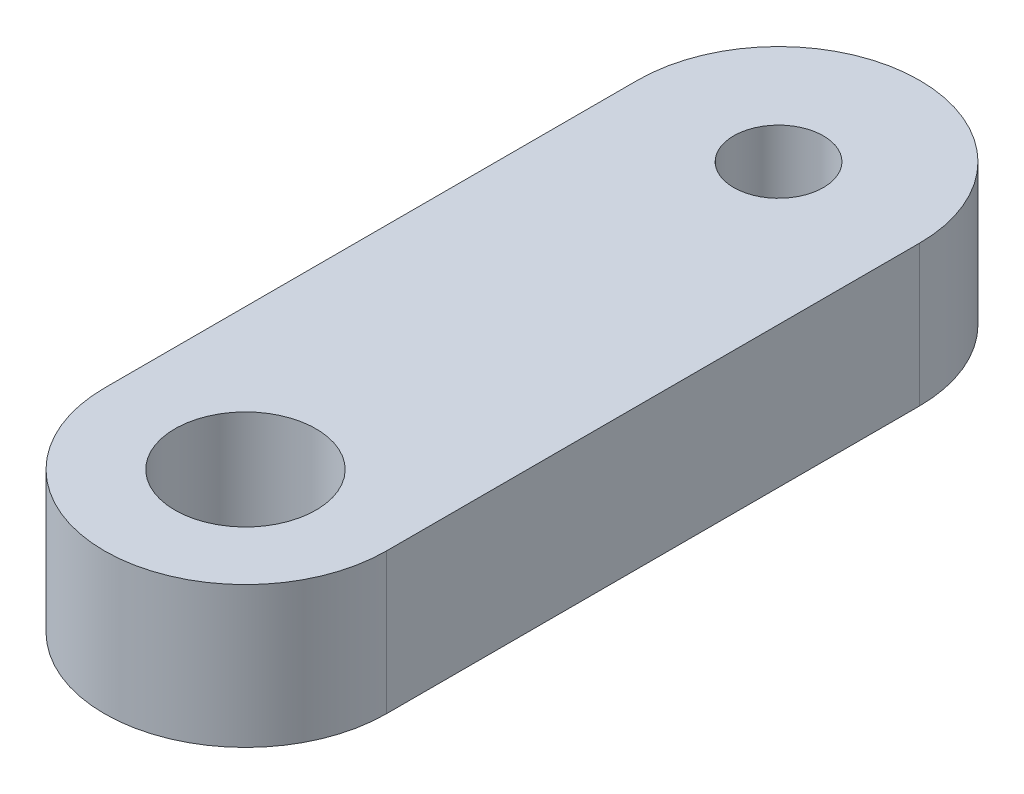
ISO-10303-21;
HEADER;
FILE_DESCRIPTION(('STEP AP214'),'2;1');
FILE_NAME('part.step','',(''),(''),'','','');
FILE_SCHEMA(('AUTOMOTIVE_DESIGN { 1 0 10303 214 1 1 1 1 }'));
ENDSEC;
DATA;
#1=APPLICATION_CONTEXT('core data for automotive mechanical design processes');
#2=APPLICATION_PROTOCOL_DEFINITION('international standard','automotive_design',2000,#1);
#3=PRODUCT_CONTEXT('',#1,'mechanical');
#4=PRODUCT('Part','Part','',(#3));
#5=PRODUCT_RELATED_PRODUCT_CATEGORY('part','',(#4));
#6=PRODUCT_DEFINITION_FORMATION('','',#4);
#7=PRODUCT_DEFINITION_CONTEXT('part definition',#1,'design');
#8=PRODUCT_DEFINITION('design','',#6,#7);
#9=PRODUCT_DEFINITION_SHAPE('','',#8);
#10=(LENGTH_UNIT() NAMED_UNIT(*) SI_UNIT(.MILLI.,.METRE.));
#11=(NAMED_UNIT(*) PLANE_ANGLE_UNIT() SI_UNIT($,.RADIAN.));
#12=(NAMED_UNIT(*) SI_UNIT($,.STERADIAN.) SOLID_ANGLE_UNIT());
#13=UNCERTAINTY_MEASURE_WITH_UNIT(LENGTH_MEASURE(1.E-05),#10,'distance_accuracy_value','');
#14=(GEOMETRIC_REPRESENTATION_CONTEXT(3) GLOBAL_UNCERTAINTY_ASSIGNED_CONTEXT((#13)) GLOBAL_UNIT_ASSIGNED_CONTEXT((#10,
#11,#12)) REPRESENTATION_CONTEXT('',''));
#15=CARTESIAN_POINT('',(0.,0.,0.));
#16=DIRECTION('',(0.,0.,1.));
#17=DIRECTION('',(1.,0.,0.));
#18=AXIS2_PLACEMENT_3D('',#15,#16,#17);
#19=CARTESIAN_POINT('',(0.,6.35,-24.));
#20=DIRECTION('',(0.,1.,0.));
#21=DIRECTION('',(0.,0.,1.));
#22=AXIS2_PLACEMENT_3D('',#19,#20,#21);
#23=PLANE('',#22);
#24=CARTESIAN_POINT('',(0.,6.35,-24.));
#25=DIRECTION('',(0.,1.,0.));
#26=DIRECTION('',(0.,0.,1.));
#27=AXIS2_PLACEMENT_3D('',#24,#25,#26);
#28=CIRCLE('',#27,2.0193);
#29=CARTESIAN_POINT('',(0.,6.35,-21.9807));
#30=VERTEX_POINT('',#29);
#31=EDGE_CURVE('E124',#30,#30,#28,.T.);
#32=ORIENTED_EDGE('',*,*,#31,.F.);
#33=EDGE_LOOP('',(#32));
#34=FACE_BOUND('',#33,.T.);
#35=CARTESIAN_POINT('',(0.,6.35,-24.));
#36=DIRECTION('',(0.,1.,0.));
#37=DIRECTION('',(0.,0.,1.));
#38=AXIS2_PLACEMENT_3D('',#35,#36,#37);
#39=CIRCLE('',#38,6.34999999999999);
#40=CARTESIAN_POINT('',(6.35,6.35,-24.));
#41=VERTEX_POINT('',#40);
#42=CARTESIAN_POINT('',(-6.34999999999999,6.35,-24.));
#43=VERTEX_POINT('',#42);
#44=EDGE_CURVE('E89',#41,#43,#39,.T.);
#45=ORIENTED_EDGE('',*,*,#44,.T.);
#46=DIRECTION('',(0.,0.,1.));
#47=VECTOR('',#46,1.);
#48=CARTESIAN_POINT('',(-6.34999999999999,6.35,-24.));
#49=LINE('',#48,#47);
#50=CARTESIAN_POINT('',(-6.34999999999999,6.35,0.));
#51=VERTEX_POINT('',#50);
#52=EDGE_CURVE('E84',#43,#51,#49,.T.);
#53=ORIENTED_EDGE('',*,*,#52,.T.);
#54=CARTESIAN_POINT('',(0.,6.35,0.));
#55=DIRECTION('',(0.,1.,0.));
#56=DIRECTION('',(0.,0.,1.));
#57=AXIS2_PLACEMENT_3D('',#54,#55,#56);
#58=CIRCLE('',#57,6.34999999999999);
#59=CARTESIAN_POINT('',(6.35,6.35,0.));
#60=VERTEX_POINT('',#59);
#61=EDGE_CURVE('E87',#51,#60,#58,.T.);
#62=ORIENTED_EDGE('',*,*,#61,.T.);
#63=DIRECTION('',(0.,0.,-1.));
#64=VECTOR('',#63,1.);
#65=CARTESIAN_POINT('',(6.35,6.35,-24.));
#66=LINE('',#65,#64);
#67=EDGE_CURVE('E54',#60,#41,#66,.T.);
#68=ORIENTED_EDGE('',*,*,#67,.T.);
#69=EDGE_LOOP('',(#45,#53,#62,#68));
#70=FACE_BOUND('',#69,.T.);
#71=CARTESIAN_POINT('',(0.,6.35,0.));
#72=DIRECTION('',(0.,1.,0.));
#73=DIRECTION('',(0.,0.,1.));
#74=AXIS2_PLACEMENT_3D('',#71,#72,#73);
#75=CIRCLE('',#74,3.175);
#76=CARTESIAN_POINT('',(0.,6.35,3.175));
#77=VERTEX_POINT('',#76);
#78=EDGE_CURVE('E104',#77,#77,#75,.T.);
#79=ORIENTED_EDGE('',*,*,#78,.F.);
#80=EDGE_LOOP('',(#79));
#81=FACE_BOUND('',#80,.T.);
#82=ADVANCED_FACE('F37',(#34,#70,#81),#23,.T.);
#83=CARTESIAN_POINT('',(0.,0.,-24.));
#84=DIRECTION('',(0.,1.,0.));
#85=DIRECTION('',(0.,0.,1.));
#86=AXIS2_PLACEMENT_3D('',#83,#84,#85);
#87=PLANE('',#86);
#88=CARTESIAN_POINT('',(0.,0.,-24.));
#89=DIRECTION('',(0.,1.,0.));
#90=DIRECTION('',(0.,0.,1.));
#91=AXIS2_PLACEMENT_3D('',#88,#89,#90);
#92=CIRCLE('',#91,2.0193);
#93=CARTESIAN_POINT('',(0.,0.,-21.9807));
#94=VERTEX_POINT('',#93);
#95=EDGE_CURVE('E119',#94,#94,#92,.T.);
#96=ORIENTED_EDGE('',*,*,#95,.T.);
#97=EDGE_LOOP('',(#96));
#98=FACE_BOUND('',#97,.T.);
#99=CARTESIAN_POINT('',(0.,0.,-24.));
#100=DIRECTION('',(0.,1.,0.));
#101=DIRECTION('',(0.,0.,1.));
#102=AXIS2_PLACEMENT_3D('',#99,#100,#101);
#103=CIRCLE('',#102,6.34999999999999);
#104=CARTESIAN_POINT('',(6.35,0.,-24.));
#105=VERTEX_POINT('',#104);
#106=CARTESIAN_POINT('',(-6.34999999999999,0.,-24.));
#107=VERTEX_POINT('',#106);
#108=EDGE_CURVE('E101',#105,#107,#103,.T.);
#109=ORIENTED_EDGE('',*,*,#108,.F.);
#110=DIRECTION('',(0.,0.,-1.));
#111=VECTOR('',#110,1.);
#112=CARTESIAN_POINT('',(6.35,0.,-24.));
#113=LINE('',#112,#111);
#114=CARTESIAN_POINT('',(6.35,0.,0.));
#115=VERTEX_POINT('',#114);
#116=EDGE_CURVE('E77',#115,#105,#113,.T.);
#117=ORIENTED_EDGE('',*,*,#116,.F.);
#118=CARTESIAN_POINT('',(0.,0.,0.));
#119=DIRECTION('',(0.,1.,0.));
#120=DIRECTION('',(0.,0.,1.));
#121=AXIS2_PLACEMENT_3D('',#118,#119,#120);
#122=CIRCLE('',#121,6.34999999999999);
#123=CARTESIAN_POINT('',(-6.34999999999999,0.,0.));
#124=VERTEX_POINT('',#123);
#125=EDGE_CURVE('E71',#124,#115,#122,.T.);
#126=ORIENTED_EDGE('',*,*,#125,.F.);
#127=DIRECTION('',(0.,0.,1.));
#128=VECTOR('',#127,1.);
#129=CARTESIAN_POINT('',(-6.34999999999999,0.,-24.));
#130=LINE('',#129,#128);
#131=EDGE_CURVE('E93',#107,#124,#130,.T.);
#132=ORIENTED_EDGE('',*,*,#131,.F.);
#133=EDGE_LOOP('',(#109,#117,#126,#132));
#134=FACE_BOUND('',#133,.T.);
#135=CARTESIAN_POINT('',(0.,0.,0.));
#136=DIRECTION('',(0.,1.,0.));
#137=DIRECTION('',(0.,0.,1.));
#138=AXIS2_PLACEMENT_3D('',#135,#136,#137);
#139=CIRCLE('',#138,3.175);
#140=CARTESIAN_POINT('',(0.,0.,3.175));
#141=VERTEX_POINT('',#140);
#142=EDGE_CURVE('E116',#141,#141,#139,.T.);
#143=ORIENTED_EDGE('',*,*,#142,.T.);
#144=EDGE_LOOP('',(#143));
#145=FACE_BOUND('',#144,.T.);
#146=ADVANCED_FACE('F112',(#98,#134,#145),#87,.F.);
#147=CARTESIAN_POINT('',(0.,6.35,-24.));
#148=DIRECTION('',(0.,-1.,0.));
#149=DIRECTION('',(0.,0.,-1.));
#150=AXIS2_PLACEMENT_3D('',#147,#148,#149);
#151=CYLINDRICAL_SURFACE('',#150,6.34999999999999);
#152=ORIENTED_EDGE('',*,*,#108,.T.);
#153=DIRECTION('',(0.,-1.,0.));
#154=VECTOR('',#153,1.);
#155=CARTESIAN_POINT('',(-6.34999999999999,6.35,-24.));
#156=LINE('',#155,#154);
#157=EDGE_CURVE('E11',#43,#107,#156,.T.);
#158=ORIENTED_EDGE('',*,*,#157,.F.);
#159=ORIENTED_EDGE('',*,*,#44,.F.);
#160=DIRECTION('',(0.,-1.,0.));
#161=VECTOR('',#160,1.);
#162=CARTESIAN_POINT('',(6.35,6.35,-24.));
#163=LINE('',#162,#161);
#164=EDGE_CURVE('E97',#41,#105,#163,.T.);
#165=ORIENTED_EDGE('',*,*,#164,.T.);
#166=EDGE_LOOP('',(#152,#158,#159,#165));
#167=FACE_BOUND('',#166,.T.);
#168=ADVANCED_FACE('F39',(#167),#151,.T.);
#169=CARTESIAN_POINT('',(-6.34999999999999,6.35,-24.));
#170=DIRECTION('',(1.,0.,0.));
#171=DIRECTION('',(0.,0.,-1.));
#172=AXIS2_PLACEMENT_3D('',#169,#170,#171);
#173=PLANE('',#172);
#174=ORIENTED_EDGE('',*,*,#131,.T.);
#175=DIRECTION('',(0.,-1.,0.));
#176=VECTOR('',#175,1.);
#177=CARTESIAN_POINT('',(-6.34999999999999,6.35,0.));
#178=LINE('',#177,#176);
#179=EDGE_CURVE('E46',#51,#124,#178,.T.);
#180=ORIENTED_EDGE('',*,*,#179,.F.);
#181=ORIENTED_EDGE('',*,*,#52,.F.);
#182=ORIENTED_EDGE('',*,*,#157,.T.);
#183=EDGE_LOOP('',(#174,#180,#181,#182));
#184=FACE_BOUND('',#183,.T.);
#185=ADVANCED_FACE('F92',(#184),#173,.F.);
#186=CARTESIAN_POINT('',(0.,6.35,0.));
#187=DIRECTION('',(0.,-1.,0.));
#188=DIRECTION('',(0.,0.,-1.));
#189=AXIS2_PLACEMENT_3D('',#186,#187,#188);
#190=CYLINDRICAL_SURFACE('',#189,6.34999999999999);
#191=ORIENTED_EDGE('',*,*,#125,.T.);
#192=DIRECTION('',(0.,-1.,0.));
#193=VECTOR('',#192,1.);
#194=CARTESIAN_POINT('',(6.35,6.35,0.));
#195=LINE('',#194,#193);
#196=EDGE_CURVE('E94',#60,#115,#195,.T.);
#197=ORIENTED_EDGE('',*,*,#196,.F.);
#198=ORIENTED_EDGE('',*,*,#61,.F.);
#199=ORIENTED_EDGE('',*,*,#179,.T.);
#200=EDGE_LOOP('',(#191,#197,#198,#199));
#201=FACE_BOUND('',#200,.T.);
#202=ADVANCED_FACE('F95',(#201),#190,.T.);
#203=CARTESIAN_POINT('',(6.35,6.35,-24.));
#204=DIRECTION('',(-1.,0.,0.));
#205=DIRECTION('',(0.,0.,1.));
#206=AXIS2_PLACEMENT_3D('',#203,#204,#205);
#207=PLANE('',#206);
#208=ORIENTED_EDGE('',*,*,#116,.T.);
#209=ORIENTED_EDGE('',*,*,#164,.F.);
#210=ORIENTED_EDGE('',*,*,#67,.F.);
#211=ORIENTED_EDGE('',*,*,#196,.T.);
#212=EDGE_LOOP('',(#208,#209,#210,#211));
#213=FACE_BOUND('',#212,.T.);
#214=ADVANCED_FACE('F109',(#213),#207,.F.);
#215=CARTESIAN_POINT('',(0.,6.35,0.));
#216=DIRECTION('',(0.,-1.,0.));
#217=DIRECTION('',(0.,0.,-1.));
#218=AXIS2_PLACEMENT_3D('',#215,#216,#217);
#219=CYLINDRICAL_SURFACE('',#218,3.175);
#220=ORIENTED_EDGE('',*,*,#78,.T.);
#221=EDGE_LOOP('',(#220));
#222=FACE_BOUND('',#221,.T.);
#223=ORIENTED_EDGE('',*,*,#142,.F.);
#224=EDGE_LOOP('',(#223));
#225=FACE_BOUND('',#224,.T.);
#226=ADVANCED_FACE('F138',(#222,#225),#219,.F.);
#227=CARTESIAN_POINT('',(0.,6.35,-24.));
#228=DIRECTION('',(0.,1.,0.));
#229=DIRECTION('',(0.,0.,1.));
#230=AXIS2_PLACEMENT_3D('',#227,#228,#229);
#231=CYLINDRICAL_SURFACE('',#230,2.0193);
#232=ORIENTED_EDGE('',*,*,#95,.F.);
#233=EDGE_LOOP('',(#232));
#234=FACE_BOUND('',#233,.T.);
#235=ORIENTED_EDGE('',*,*,#31,.T.);
#236=EDGE_LOOP('',(#235));
#237=FACE_BOUND('',#236,.T.);
#238=ADVANCED_FACE('F128',(#234,#237),#231,.F.);
#239=CLOSED_SHELL('',(#82,#146,#168,#185,#202,#214,#226,#238));
#240=MANIFOLD_SOLID_BREP('B2',#239);
#241=ADVANCED_BREP_SHAPE_REPRESENTATION('',(#18,#240),#14);
#242=SHAPE_DEFINITION_REPRESENTATION(#9,#241);
ENDSEC;
END-ISO-10303-21;
